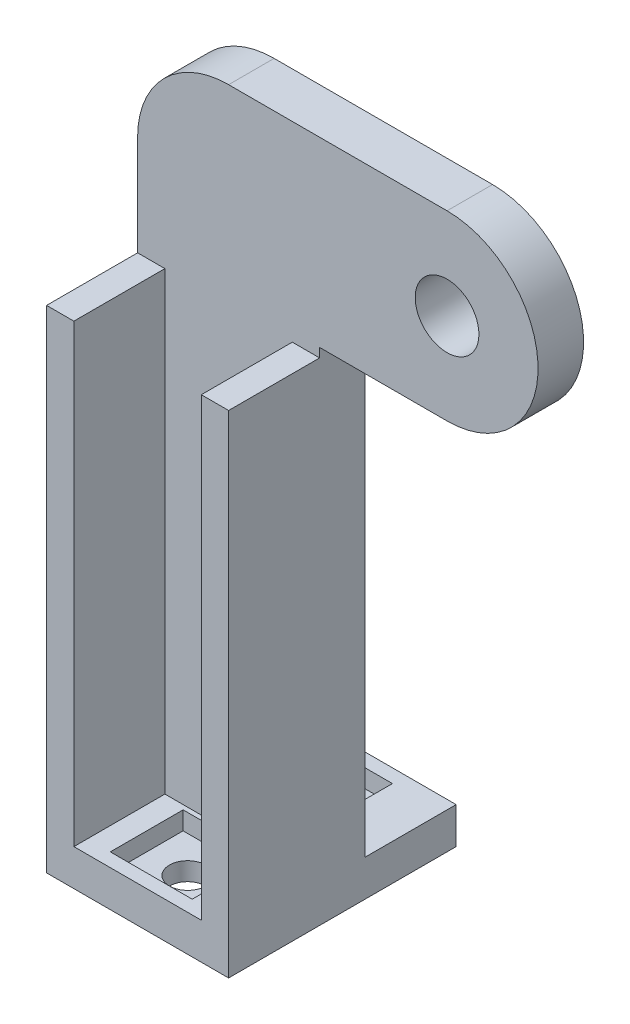
ISO-10303-21;
HEADER;
FILE_DESCRIPTION(('STEP AP214'),'2;1');
FILE_NAME('part.step','',(''),(''),'','','');
FILE_SCHEMA(('AUTOMOTIVE_DESIGN { 1 0 10303 214 1 1 1 1 }'));
ENDSEC;
DATA;
#1=APPLICATION_CONTEXT('core data for automotive mechanical design processes');
#2=APPLICATION_PROTOCOL_DEFINITION('international standard','automotive_design',2000,#1);
#3=PRODUCT_CONTEXT('',#1,'mechanical');
#4=PRODUCT('Part','Part','',(#3));
#5=PRODUCT_RELATED_PRODUCT_CATEGORY('part','',(#4));
#6=PRODUCT_DEFINITION_FORMATION('','',#4);
#7=PRODUCT_DEFINITION_CONTEXT('part definition',#1,'design');
#8=PRODUCT_DEFINITION('design','',#6,#7);
#9=PRODUCT_DEFINITION_SHAPE('','',#8);
#10=(LENGTH_UNIT() NAMED_UNIT(*) SI_UNIT(.MILLI.,.METRE.));
#11=(NAMED_UNIT(*) PLANE_ANGLE_UNIT() SI_UNIT($,.RADIAN.));
#12=(NAMED_UNIT(*) SI_UNIT($,.STERADIAN.) SOLID_ANGLE_UNIT());
#13=UNCERTAINTY_MEASURE_WITH_UNIT(LENGTH_MEASURE(1.E-05),#10,'distance_accuracy_value','');
#14=(GEOMETRIC_REPRESENTATION_CONTEXT(3) GLOBAL_UNCERTAINTY_ASSIGNED_CONTEXT((#13)) GLOBAL_UNIT_ASSIGNED_CONTEXT((#10,
#11,#12)) REPRESENTATION_CONTEXT('',''));
#15=CARTESIAN_POINT('',(0.,0.,0.));
#16=DIRECTION('',(0.,0.,1.));
#17=DIRECTION('',(1.,0.,0.));
#18=AXIS2_PLACEMENT_3D('',#15,#16,#17);
#19=CARTESIAN_POINT('',(0.,0.,2.5));
#20=DIRECTION('',(0.,0.,1.));
#21=DIRECTION('',(1.,0.,0.));
#22=AXIS2_PLACEMENT_3D('',#19,#20,#21);
#23=PLANE('',#22);
#24=DIRECTION('',(0.,-1.,0.));
#25=VECTOR('',#24,1.);
#26=CARTESIAN_POINT('',(3.5,27.,2.5));
#27=LINE('',#26,#25);
#28=CARTESIAN_POINT('',(3.5,27.,2.5));
#29=VERTEX_POINT('',#28);
#30=CARTESIAN_POINT('',(3.5,2.,2.5));
#31=VERTEX_POINT('',#30);
#32=EDGE_CURVE('E58',#29,#31,#27,.T.);
#33=ORIENTED_EDGE('',*,*,#32,.F.);
#34=DIRECTION('',(1.,0.,0.));
#35=VECTOR('',#34,1.);
#36=CARTESIAN_POINT('',(5.,27.,2.5));
#37=LINE('',#36,#35);
#38=CARTESIAN_POINT('',(5.,27.,2.5));
#39=VERTEX_POINT('',#38);
#40=EDGE_CURVE('E211',#29,#39,#37,.T.);
#41=ORIENTED_EDGE('',*,*,#40,.T.);
#42=DIRECTION('',(0.,1.,0.));
#43=VECTOR('',#42,1.);
#44=CARTESIAN_POINT('',(5.,0.,2.5));
#45=LINE('',#44,#43);
#46=CARTESIAN_POINT('',(5.,27.5,2.5));
#47=VERTEX_POINT('',#46);
#48=EDGE_CURVE('E349',#39,#47,#45,.T.);
#49=ORIENTED_EDGE('',*,*,#48,.T.);
#50=DIRECTION('',(1.,0.,0.));
#51=VECTOR('',#50,1.);
#52=CARTESIAN_POINT('',(0.,27.5,2.5));
#53=LINE('',#52,#51);
#54=CARTESIAN_POINT('',(12.,27.5,2.5));
#55=VERTEX_POINT('',#54);
#56=EDGE_CURVE('E351',#47,#55,#53,.T.);
#57=ORIENTED_EDGE('',*,*,#56,.T.);
#58=CARTESIAN_POINT('',(12.,32.5,2.5));
#59=DIRECTION('',(0.,0.,1.));
#60=DIRECTION('',(1.,0.,0.));
#61=AXIS2_PLACEMENT_3D('',#58,#59,#60);
#62=CIRCLE('',#61,4.99999999999999);
#63=CARTESIAN_POINT('',(12.,37.5,2.5));
#64=VERTEX_POINT('',#63);
#65=EDGE_CURVE('E353',#55,#64,#62,.T.);
#66=ORIENTED_EDGE('',*,*,#65,.T.);
#67=DIRECTION('',(1.,0.,0.));
#68=VECTOR('',#67,1.);
#69=CARTESIAN_POINT('',(0.,37.5,2.5));
#70=LINE('',#69,#68);
#71=CARTESIAN_POINT('',(0.,37.5,2.5));
#72=VERTEX_POINT('',#71);
#73=EDGE_CURVE('E340',#72,#64,#70,.T.);
#74=ORIENTED_EDGE('',*,*,#73,.F.);
#75=CARTESIAN_POINT('',(0.,32.5,2.5));
#76=DIRECTION('',(0.,0.,1.));
#77=DIRECTION('',(1.,0.,0.));
#78=AXIS2_PLACEMENT_3D('',#75,#76,#77);
#79=CIRCLE('',#78,5.);
#80=CARTESIAN_POINT('',(-5.,32.5,2.5));
#81=VERTEX_POINT('',#80);
#82=EDGE_CURVE('E343',#72,#81,#79,.T.);
#83=ORIENTED_EDGE('',*,*,#82,.T.);
#84=DIRECTION('',(0.,1.,0.));
#85=VECTOR('',#84,1.);
#86=CARTESIAN_POINT('',(-5.,0.,2.5));
#87=LINE('',#86,#85);
#88=CARTESIAN_POINT('',(-5.,27.,2.5));
#89=VERTEX_POINT('',#88);
#90=EDGE_CURVE('E347',#89,#81,#87,.T.);
#91=ORIENTED_EDGE('',*,*,#90,.F.);
#92=DIRECTION('',(-1.,0.,0.));
#93=VECTOR('',#92,1.);
#94=CARTESIAN_POINT('',(-5.,27.,2.5));
#95=LINE('',#94,#93);
#96=CARTESIAN_POINT('',(-3.5,27.,2.5));
#97=VERTEX_POINT('',#96);
#98=EDGE_CURVE('E233',#97,#89,#95,.T.);
#99=ORIENTED_EDGE('',*,*,#98,.F.);
#100=DIRECTION('',(0.,-1.,0.));
#101=VECTOR('',#100,1.);
#102=CARTESIAN_POINT('',(-3.5,27.,2.5));
#103=LINE('',#102,#101);
#104=CARTESIAN_POINT('',(-3.5,2.,2.5));
#105=VERTEX_POINT('',#104);
#106=EDGE_CURVE('E236',#97,#105,#103,.T.);
#107=ORIENTED_EDGE('',*,*,#106,.T.);
#108=DIRECTION('',(1.,0.,0.));
#109=VECTOR('',#108,1.);
#110=CARTESIAN_POINT('',(0.,2.,2.5));
#111=LINE('',#110,#109);
#112=EDGE_CURVE('E335',#105,#31,#111,.T.);
#113=ORIENTED_EDGE('',*,*,#112,.T.);
#114=EDGE_LOOP('',(#33,#41,#49,#57,#66,#74,#83,#91,#99,#107,#113));
#115=FACE_BOUND('',#114,.T.);
#116=CARTESIAN_POINT('',(12.,32.5,2.5));
#117=DIRECTION('',(0.,0.,1.));
#118=DIRECTION('',(1.,0.,0.));
#119=AXIS2_PLACEMENT_3D('',#116,#117,#118);
#120=CIRCLE('',#119,1.75);
#121=CARTESIAN_POINT('',(13.75,32.5,2.5));
#122=VERTEX_POINT('',#121);
#123=EDGE_CURVE('E355',#122,#122,#120,.T.);
#124=ORIENTED_EDGE('',*,*,#123,.F.);
#125=EDGE_LOOP('',(#124));
#126=FACE_BOUND('',#125,.T.);
#127=ADVANCED_FACE('F41',(#115,#126),#23,.T.);
#128=CARTESIAN_POINT('',(0.,2.,-5.));
#129=DIRECTION('',(0.,-1.,0.));
#130=DIRECTION('',(0.,0.,-1.));
#131=AXIS2_PLACEMENT_3D('',#128,#129,#130);
#132=PLANE('',#131);
#133=DIRECTION('',(-1.,0.,0.));
#134=VECTOR('',#133,1.);
#135=CARTESIAN_POINT('',(-2.25,2.,2.75));
#136=LINE('',#135,#134);
#137=CARTESIAN_POINT('',(2.25,2.,2.75));
#138=VERTEX_POINT('',#137);
#139=CARTESIAN_POINT('',(-2.25,2.,2.75));
#140=VERTEX_POINT('',#139);
#141=EDGE_CURVE('E260',#138,#140,#136,.T.);
#142=ORIENTED_EDGE('',*,*,#141,.F.);
#143=DIRECTION('',(0.,0.,-1.));
#144=VECTOR('',#143,1.);
#145=CARTESIAN_POINT('',(2.25,2.,6.75));
#146=LINE('',#145,#144);
#147=CARTESIAN_POINT('',(2.25,2.,6.75));
#148=VERTEX_POINT('',#147);
#149=EDGE_CURVE('E258',#148,#138,#146,.T.);
#150=ORIENTED_EDGE('',*,*,#149,.F.);
#151=DIRECTION('',(1.,0.,0.));
#152=VECTOR('',#151,1.);
#153=CARTESIAN_POINT('',(-2.25,2.,6.75));
#154=LINE('',#153,#152);
#155=CARTESIAN_POINT('',(-2.25,2.,6.75));
#156=VERTEX_POINT('',#155);
#157=EDGE_CURVE('E248',#156,#148,#154,.T.);
#158=ORIENTED_EDGE('',*,*,#157,.F.);
#159=DIRECTION('',(0.,0.,1.));
#160=VECTOR('',#159,1.);
#161=CARTESIAN_POINT('',(-2.25,2.,6.75));
#162=LINE('',#161,#160);
#163=EDGE_CURVE('E264',#140,#156,#162,.T.);
#164=ORIENTED_EDGE('',*,*,#163,.F.);
#165=EDGE_LOOP('',(#142,#150,#158,#164));
#166=FACE_BOUND('',#165,.T.);
#167=DIRECTION('',(1.,0.,0.));
#168=VECTOR('',#167,1.);
#169=CARTESIAN_POINT('',(0.,2.,7.5));
#170=LINE('',#169,#168);
#171=CARTESIAN_POINT('',(-3.5,2.,7.5));
#172=VERTEX_POINT('',#171);
#173=CARTESIAN_POINT('',(3.5,2.,7.5));
#174=VERTEX_POINT('',#173);
#175=EDGE_CURVE('E311',#172,#174,#170,.T.);
#176=ORIENTED_EDGE('',*,*,#175,.T.);
#177=DIRECTION('',(0.,0.,-1.));
#178=VECTOR('',#177,1.);
#179=CARTESIAN_POINT('',(3.5,2.,2.5));
#180=LINE('',#179,#178);
#181=EDGE_CURVE('E66',#174,#31,#180,.T.);
#182=ORIENTED_EDGE('',*,*,#181,.T.);
#183=ORIENTED_EDGE('',*,*,#112,.F.);
#184=DIRECTION('',(0.,0.,-1.));
#185=VECTOR('',#184,1.);
#186=CARTESIAN_POINT('',(-3.5,2.,2.5));
#187=LINE('',#186,#185);
#188=EDGE_CURVE('E224',#172,#105,#187,.T.);
#189=ORIENTED_EDGE('',*,*,#188,.F.);
#190=EDGE_LOOP('',(#176,#182,#183,#189));
#191=FACE_BOUND('',#190,.T.);
#192=ADVANCED_FACE('F417',(#166,#191),#132,.F.);
#193=CARTESIAN_POINT('',(0.,0.,0.));
#194=DIRECTION('',(0.,0.,1.));
#195=DIRECTION('',(1.,0.,0.));
#196=AXIS2_PLACEMENT_3D('',#193,#194,#195);
#197=PLANE('',#196);
#198=CARTESIAN_POINT('',(12.,32.5,0.));
#199=DIRECTION('',(0.,0.,1.));
#200=DIRECTION('',(1.,0.,0.));
#201=AXIS2_PLACEMENT_3D('',#198,#199,#200);
#202=CIRCLE('',#201,1.75);
#203=CARTESIAN_POINT('',(13.75,32.5,0.));
#204=VERTEX_POINT('',#203);
#205=EDGE_CURVE('E344',#204,#204,#202,.T.);
#206=ORIENTED_EDGE('',*,*,#205,.T.);
#207=EDGE_LOOP('',(#206));
#208=FACE_BOUND('',#207,.T.);
#209=DIRECTION('',(1.,0.,0.));
#210=VECTOR('',#209,1.);
#211=CARTESIAN_POINT('',(0.,2.,0.));
#212=LINE('',#211,#210);
#213=CARTESIAN_POINT('',(-5.,2.,0.));
#214=VERTEX_POINT('',#213);
#215=CARTESIAN_POINT('',(5.,2.,0.));
#216=VERTEX_POINT('',#215);
#217=EDGE_CURVE('E11',#214,#216,#212,.T.);
#218=ORIENTED_EDGE('',*,*,#217,.F.);
#219=DIRECTION('',(0.,1.,0.));
#220=VECTOR('',#219,1.);
#221=CARTESIAN_POINT('',(-5.,0.,0.));
#222=LINE('',#221,#220);
#223=CARTESIAN_POINT('',(-5.,32.5,0.));
#224=VERTEX_POINT('',#223);
#225=EDGE_CURVE('E364',#214,#224,#222,.T.);
#226=ORIENTED_EDGE('',*,*,#225,.T.);
#227=CARTESIAN_POINT('',(0.,32.5,0.));
#228=DIRECTION('',(0.,0.,1.));
#229=DIRECTION('',(1.,0.,0.));
#230=AXIS2_PLACEMENT_3D('',#227,#228,#229);
#231=CIRCLE('',#230,5.);
#232=CARTESIAN_POINT('',(0.,37.5,0.));
#233=VERTEX_POINT('',#232);
#234=EDGE_CURVE('E361',#233,#224,#231,.T.);
#235=ORIENTED_EDGE('',*,*,#234,.F.);
#236=DIRECTION('',(1.,0.,0.));
#237=VECTOR('',#236,1.);
#238=CARTESIAN_POINT('',(0.,37.5,0.));
#239=LINE('',#238,#237);
#240=CARTESIAN_POINT('',(12.,37.5,0.));
#241=VERTEX_POINT('',#240);
#242=EDGE_CURVE('E339',#233,#241,#239,.T.);
#243=ORIENTED_EDGE('',*,*,#242,.T.);
#244=CARTESIAN_POINT('',(12.,32.5,0.));
#245=DIRECTION('',(0.,0.,1.));
#246=DIRECTION('',(1.,0.,0.));
#247=AXIS2_PLACEMENT_3D('',#244,#245,#246);
#248=CIRCLE('',#247,4.99999999999999);
#249=CARTESIAN_POINT('',(12.,27.5,0.));
#250=VERTEX_POINT('',#249);
#251=EDGE_CURVE('E370',#250,#241,#248,.T.);
#252=ORIENTED_EDGE('',*,*,#251,.F.);
#253=DIRECTION('',(1.,0.,0.));
#254=VECTOR('',#253,1.);
#255=CARTESIAN_POINT('',(0.,27.5,0.));
#256=LINE('',#255,#254);
#257=CARTESIAN_POINT('',(5.,27.5,0.));
#258=VERTEX_POINT('',#257);
#259=EDGE_CURVE('E368',#258,#250,#256,.T.);
#260=ORIENTED_EDGE('',*,*,#259,.F.);
#261=DIRECTION('',(0.,1.,0.));
#262=VECTOR('',#261,1.);
#263=CARTESIAN_POINT('',(5.,0.,0.));
#264=LINE('',#263,#262);
#265=EDGE_CURVE('E366',#216,#258,#264,.T.);
#266=ORIENTED_EDGE('',*,*,#265,.F.);
#267=EDGE_LOOP('',(#218,#226,#235,#243,#252,#260,#266));
#268=FACE_BOUND('',#267,.T.);
#269=ADVANCED_FACE('F423',(#208,#268),#197,.F.);
#270=CARTESIAN_POINT('',(0.,37.5,2.5));
#271=DIRECTION('',(0.,1.,0.));
#272=DIRECTION('',(0.,0.,1.));
#273=AXIS2_PLACEMENT_3D('',#270,#271,#272);
#274=PLANE('',#273);
#275=ORIENTED_EDGE('',*,*,#242,.F.);
#276=DIRECTION('',(0.,0.,-1.));
#277=VECTOR('',#276,1.);
#278=CARTESIAN_POINT('',(0.,37.5,2.5));
#279=LINE('',#278,#277);
#280=EDGE_CURVE('E50',#72,#233,#279,.T.);
#281=ORIENTED_EDGE('',*,*,#280,.F.);
#282=ORIENTED_EDGE('',*,*,#73,.T.);
#283=DIRECTION('',(0.,0.,-1.));
#284=VECTOR('',#283,1.);
#285=CARTESIAN_POINT('',(12.,37.5,2.5));
#286=LINE('',#285,#284);
#287=EDGE_CURVE('E358',#64,#241,#286,.T.);
#288=ORIENTED_EDGE('',*,*,#287,.T.);
#289=EDGE_LOOP('',(#275,#281,#282,#288));
#290=FACE_BOUND('',#289,.T.);
#291=ADVANCED_FACE('F43',(#290),#274,.T.);
#292=CARTESIAN_POINT('',(0.,32.5,2.5));
#293=DIRECTION('',(0.,0.,-1.));
#294=DIRECTION('',(-1.,0.,0.));
#295=AXIS2_PLACEMENT_3D('',#292,#293,#294);
#296=CYLINDRICAL_SURFACE('',#295,5.);
#297=ORIENTED_EDGE('',*,*,#234,.T.);
#298=DIRECTION('',(0.,0.,-1.));
#299=VECTOR('',#298,1.);
#300=CARTESIAN_POINT('',(-5.,32.5,2.5));
#301=LINE('',#300,#299);
#302=EDGE_CURVE('E386',#81,#224,#301,.T.);
#303=ORIENTED_EDGE('',*,*,#302,.F.);
#304=ORIENTED_EDGE('',*,*,#82,.F.);
#305=ORIENTED_EDGE('',*,*,#280,.T.);
#306=EDGE_LOOP('',(#297,#303,#304,#305));
#307=FACE_BOUND('',#306,.T.);
#308=ADVANCED_FACE('F456',(#307),#296,.T.);
#309=CARTESIAN_POINT('',(-5.,0.,2.5));
#310=DIRECTION('',(-1.,0.,0.));
#311=DIRECTION('',(0.,0.,1.));
#312=AXIS2_PLACEMENT_3D('',#309,#310,#311);
#313=PLANE('',#312);
#314=DIRECTION('',(0.,0.,1.));
#315=VECTOR('',#314,1.);
#316=CARTESIAN_POINT('',(-5.,27.,2.5));
#317=LINE('',#316,#315);
#318=CARTESIAN_POINT('',(-5.,27.,7.5));
#319=VERTEX_POINT('',#318);
#320=EDGE_CURVE('E225',#89,#319,#317,.T.);
#321=ORIENTED_EDGE('',*,*,#320,.F.);
#322=ORIENTED_EDGE('',*,*,#90,.T.);
#323=ORIENTED_EDGE('',*,*,#302,.T.);
#324=ORIENTED_EDGE('',*,*,#225,.F.);
#325=DIRECTION('',(0.,0.,1.));
#326=VECTOR('',#325,1.);
#327=CARTESIAN_POINT('',(-5.,2.,-5.));
#328=LINE('',#327,#326);
#329=CARTESIAN_POINT('',(-5.,2.,-5.));
#330=VERTEX_POINT('',#329);
#331=EDGE_CURVE('E331',#330,#214,#328,.T.);
#332=ORIENTED_EDGE('',*,*,#331,.F.);
#333=DIRECTION('',(0.,1.,0.));
#334=VECTOR('',#333,1.);
#335=CARTESIAN_POINT('',(-5.,0.,-5.));
#336=LINE('',#335,#334);
#337=CARTESIAN_POINT('',(-5.,0.,-5.));
#338=VERTEX_POINT('',#337);
#339=EDGE_CURVE('E323',#338,#330,#336,.T.);
#340=ORIENTED_EDGE('',*,*,#339,.F.);
#341=DIRECTION('',(0.,0.,-1.));
#342=VECTOR('',#341,1.);
#343=CARTESIAN_POINT('',(-5.,0.,2.5));
#344=LINE('',#343,#342);
#345=CARTESIAN_POINT('',(-5.,0.,7.5));
#346=VERTEX_POINT('',#345);
#347=EDGE_CURVE('E384',#346,#338,#344,.T.);
#348=ORIENTED_EDGE('',*,*,#347,.F.);
#349=DIRECTION('',(0.,1.,0.));
#350=VECTOR('',#349,1.);
#351=CARTESIAN_POINT('',(-5.,0.,7.5));
#352=LINE('',#351,#350);
#353=EDGE_CURVE('E316',#346,#319,#352,.T.);
#354=ORIENTED_EDGE('',*,*,#353,.T.);
#355=EDGE_LOOP('',(#321,#322,#323,#324,#332,#340,#348,#354));
#356=FACE_BOUND('',#355,.T.);
#357=ADVANCED_FACE('F453',(#356),#313,.T.);
#358=CARTESIAN_POINT('',(0.,0.,2.5));
#359=DIRECTION('',(0.,1.,0.));
#360=DIRECTION('',(0.,0.,1.));
#361=AXIS2_PLACEMENT_3D('',#358,#359,#360);
#362=PLANE('',#361);
#363=CARTESIAN_POINT('',(0.,0.,-2.25));
#364=DIRECTION('',(0.,1.,0.));
#365=DIRECTION('',(0.,0.,1.));
#366=AXIS2_PLACEMENT_3D('',#363,#364,#365);
#367=CIRCLE('',#366,1.);
#368=CARTESIAN_POINT('',(0.,0.,-1.25));
#369=VERTEX_POINT('',#368);
#370=EDGE_CURVE('E308',#369,#369,#367,.T.);
#371=ORIENTED_EDGE('',*,*,#370,.T.);
#372=EDGE_LOOP('',(#371));
#373=FACE_BOUND('',#372,.T.);
#374=CARTESIAN_POINT('',(0.,0.,4.75));
#375=DIRECTION('',(0.,1.,0.));
#376=DIRECTION('',(0.,0.,1.));
#377=AXIS2_PLACEMENT_3D('',#374,#375,#376);
#378=CIRCLE('',#377,1.);
#379=CARTESIAN_POINT('',(0.,0.,5.75));
#380=VERTEX_POINT('',#379);
#381=EDGE_CURVE('E312',#380,#380,#378,.T.);
#382=ORIENTED_EDGE('',*,*,#381,.T.);
#383=EDGE_LOOP('',(#382));
#384=FACE_BOUND('',#383,.T.);
#385=ORIENTED_EDGE('',*,*,#347,.T.);
#386=DIRECTION('',(1.,0.,0.));
#387=VECTOR('',#386,1.);
#388=CARTESIAN_POINT('',(0.,0.,-5.));
#389=LINE('',#388,#387);
#390=CARTESIAN_POINT('',(5.,0.,-5.));
#391=VERTEX_POINT('',#390);
#392=EDGE_CURVE('E325',#338,#391,#389,.T.);
#393=ORIENTED_EDGE('',*,*,#392,.T.);
#394=DIRECTION('',(0.,0.,-1.));
#395=VECTOR('',#394,1.);
#396=CARTESIAN_POINT('',(5.,0.,2.5));
#397=LINE('',#396,#395);
#398=CARTESIAN_POINT('',(5.,0.,7.5));
#399=VERTEX_POINT('',#398);
#400=EDGE_CURVE('E382',#399,#391,#397,.T.);
#401=ORIENTED_EDGE('',*,*,#400,.F.);
#402=DIRECTION('',(1.,0.,0.));
#403=VECTOR('',#402,1.);
#404=CARTESIAN_POINT('',(0.,0.,7.5));
#405=LINE('',#404,#403);
#406=EDGE_CURVE('E318',#346,#399,#405,.T.);
#407=ORIENTED_EDGE('',*,*,#406,.F.);
#408=EDGE_LOOP('',(#385,#393,#401,#407));
#409=FACE_BOUND('',#408,.T.);
#410=ADVANCED_FACE('F449',(#373,#384,#409),#362,.F.);
#411=CARTESIAN_POINT('',(5.,0.,2.5));
#412=DIRECTION('',(-1.,0.,0.));
#413=DIRECTION('',(0.,0.,1.));
#414=AXIS2_PLACEMENT_3D('',#411,#412,#413);
#415=PLANE('',#414);
#416=ORIENTED_EDGE('',*,*,#48,.F.);
#417=DIRECTION('',(0.,0.,1.));
#418=VECTOR('',#417,1.);
#419=CARTESIAN_POINT('',(5.,27.,2.5));
#420=LINE('',#419,#418);
#421=CARTESIAN_POINT('',(5.,27.,7.5));
#422=VERTEX_POINT('',#421);
#423=EDGE_CURVE('E221',#39,#422,#420,.T.);
#424=ORIENTED_EDGE('',*,*,#423,.T.);
#425=DIRECTION('',(0.,1.,0.));
#426=VECTOR('',#425,1.);
#427=CARTESIAN_POINT('',(5.,0.,7.5));
#428=LINE('',#427,#426);
#429=EDGE_CURVE('E216',#399,#422,#428,.T.);
#430=ORIENTED_EDGE('',*,*,#429,.F.);
#431=ORIENTED_EDGE('',*,*,#400,.T.);
#432=DIRECTION('',(0.,1.,0.));
#433=VECTOR('',#432,1.);
#434=CARTESIAN_POINT('',(5.,0.,-5.));
#435=LINE('',#434,#433);
#436=CARTESIAN_POINT('',(5.,2.,-5.));
#437=VERTEX_POINT('',#436);
#438=EDGE_CURVE('E328',#391,#437,#435,.T.);
#439=ORIENTED_EDGE('',*,*,#438,.T.);
#440=DIRECTION('',(0.,0.,1.));
#441=VECTOR('',#440,1.);
#442=CARTESIAN_POINT('',(5.,2.,-5.));
#443=LINE('',#442,#441);
#444=EDGE_CURVE('E332',#437,#216,#443,.T.);
#445=ORIENTED_EDGE('',*,*,#444,.T.);
#446=ORIENTED_EDGE('',*,*,#265,.T.);
#447=DIRECTION('',(0.,0.,-1.));
#448=VECTOR('',#447,1.);
#449=CARTESIAN_POINT('',(5.,27.5,2.5));
#450=LINE('',#449,#448);
#451=EDGE_CURVE('E379',#47,#258,#450,.T.);
#452=ORIENTED_EDGE('',*,*,#451,.F.);
#453=EDGE_LOOP('',(#416,#424,#430,#431,#439,#445,#446,#452));
#454=FACE_BOUND('',#453,.T.);
#455=ADVANCED_FACE('F445',(#454),#415,.F.);
#456=CARTESIAN_POINT('',(0.,27.5,2.5));
#457=DIRECTION('',(0.,1.,0.));
#458=DIRECTION('',(0.,0.,1.));
#459=AXIS2_PLACEMENT_3D('',#456,#457,#458);
#460=PLANE('',#459);
#461=ORIENTED_EDGE('',*,*,#259,.T.);
#462=DIRECTION('',(0.,0.,-1.));
#463=VECTOR('',#462,1.);
#464=CARTESIAN_POINT('',(12.,27.5,2.5));
#465=LINE('',#464,#463);
#466=EDGE_CURVE('E376',#55,#250,#465,.T.);
#467=ORIENTED_EDGE('',*,*,#466,.F.);
#468=ORIENTED_EDGE('',*,*,#56,.F.);
#469=ORIENTED_EDGE('',*,*,#451,.T.);
#470=EDGE_LOOP('',(#461,#467,#468,#469));
#471=FACE_BOUND('',#470,.T.);
#472=ADVANCED_FACE('F441',(#471),#460,.F.);
#473=CARTESIAN_POINT('',(12.,32.5,2.5));
#474=DIRECTION('',(0.,0.,-1.));
#475=DIRECTION('',(-1.,0.,0.));
#476=AXIS2_PLACEMENT_3D('',#473,#474,#475);
#477=CYLINDRICAL_SURFACE('',#476,4.99999999999999);
#478=ORIENTED_EDGE('',*,*,#251,.T.);
#479=ORIENTED_EDGE('',*,*,#287,.F.);
#480=ORIENTED_EDGE('',*,*,#65,.F.);
#481=ORIENTED_EDGE('',*,*,#466,.T.);
#482=EDGE_LOOP('',(#478,#479,#480,#481));
#483=FACE_BOUND('',#482,.T.);
#484=ADVANCED_FACE('F437',(#483),#477,.T.);
#485=CARTESIAN_POINT('',(12.,32.5,2.5));
#486=DIRECTION('',(0.,0.,-1.));
#487=DIRECTION('',(-1.,0.,0.));
#488=AXIS2_PLACEMENT_3D('',#485,#486,#487);
#489=CYLINDRICAL_SURFACE('',#488,1.75);
#490=ORIENTED_EDGE('',*,*,#123,.T.);
#491=EDGE_LOOP('',(#490));
#492=FACE_BOUND('',#491,.T.);
#493=ORIENTED_EDGE('',*,*,#205,.F.);
#494=EDGE_LOOP('',(#493));
#495=FACE_BOUND('',#494,.T.);
#496=ADVANCED_FACE('F433',(#492,#495),#489,.F.);
#497=CARTESIAN_POINT('',(0.,0.,-5.));
#498=DIRECTION('',(0.,0.,1.));
#499=DIRECTION('',(1.,0.,0.));
#500=AXIS2_PLACEMENT_3D('',#497,#498,#499);
#501=PLANE('',#500);
#502=DIRECTION('',(1.,0.,0.));
#503=VECTOR('',#502,1.);
#504=CARTESIAN_POINT('',(0.,2.,-5.));
#505=LINE('',#504,#503);
#506=EDGE_CURVE('E321',#330,#437,#505,.T.);
#507=ORIENTED_EDGE('',*,*,#506,.T.);
#508=ORIENTED_EDGE('',*,*,#438,.F.);
#509=ORIENTED_EDGE('',*,*,#392,.F.);
#510=ORIENTED_EDGE('',*,*,#339,.T.);
#511=EDGE_LOOP('',(#507,#508,#509,#510));
#512=FACE_BOUND('',#511,.T.);
#513=ADVANCED_FACE('F436',(#512),#501,.F.);
#514=DIRECTION('',(-1.,0.,0.));
#515=VECTOR('',#514,1.);
#516=CARTESIAN_POINT('',(-2.25,2.,-4.25));
#517=LINE('',#516,#515);
#518=CARTESIAN_POINT('',(2.25,2.,-4.25));
#519=VERTEX_POINT('',#518);
#520=CARTESIAN_POINT('',(-2.25,2.,-4.25));
#521=VERTEX_POINT('',#520);
#522=EDGE_CURVE('E294',#519,#521,#517,.T.);
#523=ORIENTED_EDGE('',*,*,#522,.F.);
#524=DIRECTION('',(0.,0.,-1.));
#525=VECTOR('',#524,1.);
#526=CARTESIAN_POINT('',(2.25,2.,-0.25));
#527=LINE('',#526,#525);
#528=CARTESIAN_POINT('',(2.25,2.,-0.25));
#529=VERTEX_POINT('',#528);
#530=EDGE_CURVE('E261',#529,#519,#527,.T.);
#531=ORIENTED_EDGE('',*,*,#530,.F.);
#532=DIRECTION('',(1.,0.,0.));
#533=VECTOR('',#532,1.);
#534=CARTESIAN_POINT('',(-2.25,2.,-0.25));
#535=LINE('',#534,#533);
#536=CARTESIAN_POINT('',(-2.25,2.,-0.25));
#537=VERTEX_POINT('',#536);
#538=EDGE_CURVE('E287',#537,#529,#535,.T.);
#539=ORIENTED_EDGE('',*,*,#538,.F.);
#540=DIRECTION('',(0.,0.,1.));
#541=VECTOR('',#540,1.);
#542=CARTESIAN_POINT('',(-2.25,2.,-0.25));
#543=LINE('',#542,#541);
#544=EDGE_CURVE('E290',#521,#537,#543,.T.);
#545=ORIENTED_EDGE('',*,*,#544,.F.);
#546=EDGE_LOOP('',(#523,#531,#539,#545));
#547=FACE_BOUND('',#546,.T.);
#548=ORIENTED_EDGE('',*,*,#331,.T.);
#549=ORIENTED_EDGE('',*,*,#217,.T.);
#550=ORIENTED_EDGE('',*,*,#444,.F.);
#551=ORIENTED_EDGE('',*,*,#506,.F.);
#552=EDGE_LOOP('',(#548,#549,#550,#551));
#553=FACE_BOUND('',#552,.T.);
#554=ADVANCED_FACE('F426',(#547,#553),#132,.F.);
#555=CARTESIAN_POINT('',(0.,0.,7.5));
#556=DIRECTION('',(0.,0.,1.));
#557=DIRECTION('',(1.,0.,0.));
#558=AXIS2_PLACEMENT_3D('',#555,#556,#557);
#559=PLANE('',#558);
#560=ORIENTED_EDGE('',*,*,#175,.F.);
#561=DIRECTION('',(0.,-1.,0.));
#562=VECTOR('',#561,1.);
#563=CARTESIAN_POINT('',(-3.5,27.,7.5));
#564=LINE('',#563,#562);
#565=CARTESIAN_POINT('',(-3.5,27.,7.5));
#566=VERTEX_POINT('',#565);
#567=EDGE_CURVE('E240',#566,#172,#564,.T.);
#568=ORIENTED_EDGE('',*,*,#567,.F.);
#569=DIRECTION('',(1.,0.,0.));
#570=VECTOR('',#569,1.);
#571=CARTESIAN_POINT('',(-5.,27.,7.5));
#572=LINE('',#571,#570);
#573=EDGE_CURVE('E228',#319,#566,#572,.T.);
#574=ORIENTED_EDGE('',*,*,#573,.F.);
#575=ORIENTED_EDGE('',*,*,#353,.F.);
#576=ORIENTED_EDGE('',*,*,#406,.T.);
#577=ORIENTED_EDGE('',*,*,#429,.T.);
#578=DIRECTION('',(-1.,0.,0.));
#579=VECTOR('',#578,1.);
#580=CARTESIAN_POINT('',(5.,27.,7.5));
#581=LINE('',#580,#579);
#582=CARTESIAN_POINT('',(3.5,27.,7.5));
#583=VERTEX_POINT('',#582);
#584=EDGE_CURVE('E205',#422,#583,#581,.T.);
#585=ORIENTED_EDGE('',*,*,#584,.T.);
#586=DIRECTION('',(0.,-1.,0.));
#587=VECTOR('',#586,1.);
#588=CARTESIAN_POINT('',(3.5,27.,7.5));
#589=LINE('',#588,#587);
#590=EDGE_CURVE('E199',#583,#174,#589,.T.);
#591=ORIENTED_EDGE('',*,*,#590,.T.);
#592=EDGE_LOOP('',(#560,#568,#574,#575,#576,#577,#585,#591));
#593=FACE_BOUND('',#592,.T.);
#594=ADVANCED_FACE('F213',(#593),#559,.T.);
#595=CARTESIAN_POINT('',(0.,0.,4.75));
#596=DIRECTION('',(0.,1.,0.));
#597=DIRECTION('',(0.,0.,1.));
#598=AXIS2_PLACEMENT_3D('',#595,#596,#597);
#599=CYLINDRICAL_SURFACE('',#598,1.);
#600=CARTESIAN_POINT('',(0.,1.,4.75));
#601=DIRECTION('',(0.,-1.,0.));
#602=DIRECTION('',(0.,0.,-1.));
#603=AXIS2_PLACEMENT_3D('',#600,#601,#602);
#604=CIRCLE('',#603,1.);
#605=CARTESIAN_POINT('',(0.,1.,3.75));
#606=VERTEX_POINT('',#605);
#607=EDGE_CURVE('E45',#606,#606,#604,.F.);
#608=ORIENTED_EDGE('',*,*,#607,.T.);
#609=EDGE_LOOP('',(#608));
#610=FACE_BOUND('',#609,.T.);
#611=ORIENTED_EDGE('',*,*,#381,.F.);
#612=EDGE_LOOP('',(#611));
#613=FACE_BOUND('',#612,.T.);
#614=ADVANCED_FACE('F395',(#610,#613),#599,.F.);
#615=CARTESIAN_POINT('',(0.,0.,-2.25));
#616=DIRECTION('',(0.,1.,0.));
#617=DIRECTION('',(0.,0.,1.));
#618=AXIS2_PLACEMENT_3D('',#615,#616,#617);
#619=CYLINDRICAL_SURFACE('',#618,1.);
#620=CARTESIAN_POINT('',(0.,1.,-2.25));
#621=DIRECTION('',(0.,-1.,0.));
#622=DIRECTION('',(0.,0.,-1.));
#623=AXIS2_PLACEMENT_3D('',#620,#621,#622);
#624=CIRCLE('',#623,1.);
#625=CARTESIAN_POINT('',(0.,1.,-3.25));
#626=VERTEX_POINT('',#625);
#627=EDGE_CURVE('E271',#626,#626,#624,.F.);
#628=ORIENTED_EDGE('',*,*,#627,.T.);
#629=EDGE_LOOP('',(#628));
#630=FACE_BOUND('',#629,.T.);
#631=ORIENTED_EDGE('',*,*,#370,.F.);
#632=EDGE_LOOP('',(#631));
#633=FACE_BOUND('',#632,.T.);
#634=ADVANCED_FACE('F501',(#630,#633),#619,.F.);
#635=CARTESIAN_POINT('',(0.,1.,0.));
#636=DIRECTION('',(0.,-1.,0.));
#637=DIRECTION('',(0.,0.,-1.));
#638=AXIS2_PLACEMENT_3D('',#635,#636,#637);
#639=PLANE('',#638);
#640=DIRECTION('',(0.,0.,-1.));
#641=VECTOR('',#640,1.);
#642=CARTESIAN_POINT('',(2.25,1.,-0.25));
#643=LINE('',#642,#641);
#644=CARTESIAN_POINT('',(2.25,1.,-0.25));
#645=VERTEX_POINT('',#644);
#646=CARTESIAN_POINT('',(2.25,1.,-4.25));
#647=VERTEX_POINT('',#646);
#648=EDGE_CURVE('E291',#645,#647,#643,.T.);
#649=ORIENTED_EDGE('',*,*,#648,.T.);
#650=DIRECTION('',(-1.,0.,0.));
#651=VECTOR('',#650,1.);
#652=CARTESIAN_POINT('',(-2.25,1.,-4.25));
#653=LINE('',#652,#651);
#654=CARTESIAN_POINT('',(-2.25,1.,-4.25));
#655=VERTEX_POINT('',#654);
#656=EDGE_CURVE('E303',#647,#655,#653,.T.);
#657=ORIENTED_EDGE('',*,*,#656,.T.);
#658=DIRECTION('',(0.,0.,1.));
#659=VECTOR('',#658,1.);
#660=CARTESIAN_POINT('',(-2.25,1.,-0.25));
#661=LINE('',#660,#659);
#662=CARTESIAN_POINT('',(-2.25,1.,-0.25));
#663=VERTEX_POINT('',#662);
#664=EDGE_CURVE('E300',#655,#663,#661,.T.);
#665=ORIENTED_EDGE('',*,*,#664,.T.);
#666=DIRECTION('',(1.,0.,0.));
#667=VECTOR('',#666,1.);
#668=CARTESIAN_POINT('',(-2.25,1.,-0.25));
#669=LINE('',#668,#667);
#670=EDGE_CURVE('E281',#663,#645,#669,.T.);
#671=ORIENTED_EDGE('',*,*,#670,.T.);
#672=EDGE_LOOP('',(#649,#657,#665,#671));
#673=FACE_BOUND('',#672,.T.);
#674=ORIENTED_EDGE('',*,*,#627,.F.);
#675=EDGE_LOOP('',(#674));
#676=FACE_BOUND('',#675,.T.);
#677=ADVANCED_FACE('F504',(#673,#676),#639,.F.);
#678=CARTESIAN_POINT('',(2.25,1.,-0.25));
#679=DIRECTION('',(1.,0.,0.));
#680=DIRECTION('',(0.,0.,-1.));
#681=AXIS2_PLACEMENT_3D('',#678,#679,#680);
#682=PLANE('',#681);
#683=ORIENTED_EDGE('',*,*,#530,.T.);
#684=DIRECTION('',(0.,1.,0.));
#685=VECTOR('',#684,1.);
#686=CARTESIAN_POINT('',(2.25,1.,-4.25));
#687=LINE('',#686,#685);
#688=EDGE_CURVE('E278',#647,#519,#687,.T.);
#689=ORIENTED_EDGE('',*,*,#688,.F.);
#690=ORIENTED_EDGE('',*,*,#648,.F.);
#691=DIRECTION('',(0.,1.,0.));
#692=VECTOR('',#691,1.);
#693=CARTESIAN_POINT('',(2.25,1.,-0.25));
#694=LINE('',#693,#692);
#695=EDGE_CURVE('E243',#645,#529,#694,.T.);
#696=ORIENTED_EDGE('',*,*,#695,.T.);
#697=EDGE_LOOP('',(#683,#689,#690,#696));
#698=FACE_BOUND('',#697,.T.);
#699=ADVANCED_FACE('F507',(#698),#682,.F.);
#700=CARTESIAN_POINT('',(-2.25,1.,-0.25));
#701=DIRECTION('',(0.,0.,1.));
#702=DIRECTION('',(1.,0.,0.));
#703=AXIS2_PLACEMENT_3D('',#700,#701,#702);
#704=PLANE('',#703);
#705=ORIENTED_EDGE('',*,*,#538,.T.);
#706=ORIENTED_EDGE('',*,*,#695,.F.);
#707=ORIENTED_EDGE('',*,*,#670,.F.);
#708=DIRECTION('',(0.,1.,0.));
#709=VECTOR('',#708,1.);
#710=CARTESIAN_POINT('',(-2.25,1.,-0.25));
#711=LINE('',#710,#709);
#712=EDGE_CURVE('E284',#663,#537,#711,.T.);
#713=ORIENTED_EDGE('',*,*,#712,.T.);
#714=EDGE_LOOP('',(#705,#706,#707,#713));
#715=FACE_BOUND('',#714,.T.);
#716=ADVANCED_FACE('F509',(#715),#704,.F.);
#717=CARTESIAN_POINT('',(-2.25,1.,-0.25));
#718=DIRECTION('',(-1.,0.,0.));
#719=DIRECTION('',(0.,0.,1.));
#720=AXIS2_PLACEMENT_3D('',#717,#718,#719);
#721=PLANE('',#720);
#722=ORIENTED_EDGE('',*,*,#544,.T.);
#723=ORIENTED_EDGE('',*,*,#712,.F.);
#724=ORIENTED_EDGE('',*,*,#664,.F.);
#725=DIRECTION('',(0.,1.,0.));
#726=VECTOR('',#725,1.);
#727=CARTESIAN_POINT('',(-2.25,1.,-4.25));
#728=LINE('',#727,#726);
#729=EDGE_CURVE('E282',#655,#521,#728,.T.);
#730=ORIENTED_EDGE('',*,*,#729,.T.);
#731=EDGE_LOOP('',(#722,#723,#724,#730));
#732=FACE_BOUND('',#731,.T.);
#733=ADVANCED_FACE('F411',(#732),#721,.F.);
#734=CARTESIAN_POINT('',(-2.25,1.,-4.25));
#735=DIRECTION('',(0.,0.,-1.));
#736=DIRECTION('',(-1.,0.,0.));
#737=AXIS2_PLACEMENT_3D('',#734,#735,#736);
#738=PLANE('',#737);
#739=ORIENTED_EDGE('',*,*,#522,.T.);
#740=ORIENTED_EDGE('',*,*,#729,.F.);
#741=ORIENTED_EDGE('',*,*,#656,.F.);
#742=ORIENTED_EDGE('',*,*,#688,.T.);
#743=EDGE_LOOP('',(#739,#740,#741,#742));
#744=FACE_BOUND('',#743,.T.);
#745=ADVANCED_FACE('F401',(#744),#738,.F.);
#746=CARTESIAN_POINT('',(0.,1.,0.));
#747=DIRECTION('',(0.,-1.,0.));
#748=DIRECTION('',(0.,0.,-1.));
#749=AXIS2_PLACEMENT_3D('',#746,#747,#748);
#750=PLANE('',#749);
#751=DIRECTION('',(0.,0.,-1.));
#752=VECTOR('',#751,1.);
#753=CARTESIAN_POINT('',(2.25,1.,6.75));
#754=LINE('',#753,#752);
#755=CARTESIAN_POINT('',(2.25,1.,6.75));
#756=VERTEX_POINT('',#755);
#757=CARTESIAN_POINT('',(2.25,1.,2.75));
#758=VERTEX_POINT('',#757);
#759=EDGE_CURVE('E244',#756,#758,#754,.T.);
#760=ORIENTED_EDGE('',*,*,#759,.T.);
#761=DIRECTION('',(-1.,0.,0.));
#762=VECTOR('',#761,1.);
#763=CARTESIAN_POINT('',(-2.25,1.,2.75));
#764=LINE('',#763,#762);
#765=CARTESIAN_POINT('',(-2.25,1.,2.75));
#766=VERTEX_POINT('',#765);
#767=EDGE_CURVE('E247',#758,#766,#764,.T.);
#768=ORIENTED_EDGE('',*,*,#767,.T.);
#769=DIRECTION('',(0.,0.,1.));
#770=VECTOR('',#769,1.);
#771=CARTESIAN_POINT('',(-2.25,1.,6.75));
#772=LINE('',#771,#770);
#773=CARTESIAN_POINT('',(-2.25,1.,6.75));
#774=VERTEX_POINT('',#773);
#775=EDGE_CURVE('E251',#766,#774,#772,.T.);
#776=ORIENTED_EDGE('',*,*,#775,.T.);
#777=DIRECTION('',(1.,0.,0.));
#778=VECTOR('',#777,1.);
#779=CARTESIAN_POINT('',(-2.25,1.,6.75));
#780=LINE('',#779,#778);
#781=EDGE_CURVE('E254',#774,#756,#780,.T.);
#782=ORIENTED_EDGE('',*,*,#781,.T.);
#783=EDGE_LOOP('',(#760,#768,#776,#782));
#784=FACE_BOUND('',#783,.T.);
#785=ORIENTED_EDGE('',*,*,#607,.F.);
#786=EDGE_LOOP('',(#785));
#787=FACE_BOUND('',#786,.T.);
#788=ADVANCED_FACE('F398',(#784,#787),#750,.F.);
#789=CARTESIAN_POINT('',(2.25,1.,6.75));
#790=DIRECTION('',(1.,0.,0.));
#791=DIRECTION('',(0.,0.,-1.));
#792=AXIS2_PLACEMENT_3D('',#789,#790,#791);
#793=PLANE('',#792);
#794=ORIENTED_EDGE('',*,*,#149,.T.);
#795=DIRECTION('',(0.,1.,0.));
#796=VECTOR('',#795,1.);
#797=CARTESIAN_POINT('',(2.25,1.,2.75));
#798=LINE('',#797,#796);
#799=EDGE_CURVE('E257',#758,#138,#798,.T.);
#800=ORIENTED_EDGE('',*,*,#799,.F.);
#801=ORIENTED_EDGE('',*,*,#759,.F.);
#802=DIRECTION('',(0.,1.,0.));
#803=VECTOR('',#802,1.);
#804=CARTESIAN_POINT('',(2.25,1.,6.75));
#805=LINE('',#804,#803);
#806=EDGE_CURVE('E269',#756,#148,#805,.T.);
#807=ORIENTED_EDGE('',*,*,#806,.T.);
#808=EDGE_LOOP('',(#794,#800,#801,#807));
#809=FACE_BOUND('',#808,.T.);
#810=ADVANCED_FACE('F400',(#809),#793,.F.);
#811=CARTESIAN_POINT('',(-2.25,1.,6.75));
#812=DIRECTION('',(0.,0.,1.));
#813=DIRECTION('',(1.,0.,0.));
#814=AXIS2_PLACEMENT_3D('',#811,#812,#813);
#815=PLANE('',#814);
#816=ORIENTED_EDGE('',*,*,#157,.T.);
#817=ORIENTED_EDGE('',*,*,#806,.F.);
#818=ORIENTED_EDGE('',*,*,#781,.F.);
#819=DIRECTION('',(0.,1.,0.));
#820=VECTOR('',#819,1.);
#821=CARTESIAN_POINT('',(-2.25,1.,6.75));
#822=LINE('',#821,#820);
#823=EDGE_CURVE('E272',#774,#156,#822,.T.);
#824=ORIENTED_EDGE('',*,*,#823,.T.);
#825=EDGE_LOOP('',(#816,#817,#818,#824));
#826=FACE_BOUND('',#825,.T.);
#827=ADVANCED_FACE('F408',(#826),#815,.F.);
#828=CARTESIAN_POINT('',(-2.25,1.,6.75));
#829=DIRECTION('',(-1.,0.,0.));
#830=DIRECTION('',(0.,0.,1.));
#831=AXIS2_PLACEMENT_3D('',#828,#829,#830);
#832=PLANE('',#831);
#833=ORIENTED_EDGE('',*,*,#163,.T.);
#834=ORIENTED_EDGE('',*,*,#823,.F.);
#835=ORIENTED_EDGE('',*,*,#775,.F.);
#836=DIRECTION('',(0.,1.,0.));
#837=VECTOR('',#836,1.);
#838=CARTESIAN_POINT('',(-2.25,1.,2.75));
#839=LINE('',#838,#837);
#840=EDGE_CURVE('E274',#766,#140,#839,.T.);
#841=ORIENTED_EDGE('',*,*,#840,.T.);
#842=EDGE_LOOP('',(#833,#834,#835,#841));
#843=FACE_BOUND('',#842,.T.);
#844=ADVANCED_FACE('F523',(#843),#832,.F.);
#845=CARTESIAN_POINT('',(-2.25,1.,2.75));
#846=DIRECTION('',(0.,0.,-1.));
#847=DIRECTION('',(-1.,0.,0.));
#848=AXIS2_PLACEMENT_3D('',#845,#846,#847);
#849=PLANE('',#848);
#850=ORIENTED_EDGE('',*,*,#141,.T.);
#851=ORIENTED_EDGE('',*,*,#840,.F.);
#852=ORIENTED_EDGE('',*,*,#767,.F.);
#853=ORIENTED_EDGE('',*,*,#799,.T.);
#854=EDGE_LOOP('',(#850,#851,#852,#853));
#855=FACE_BOUND('',#854,.T.);
#856=ADVANCED_FACE('F519',(#855),#849,.F.);
#857=CARTESIAN_POINT('',(-3.5,27.,2.5));
#858=DIRECTION('',(-1.,0.,0.));
#859=DIRECTION('',(0.,0.,1.));
#860=AXIS2_PLACEMENT_3D('',#857,#858,#859);
#861=PLANE('',#860);
#862=ORIENTED_EDGE('',*,*,#188,.T.);
#863=ORIENTED_EDGE('',*,*,#106,.F.);
#864=DIRECTION('',(0.,0.,-1.));
#865=VECTOR('',#864,1.);
#866=CARTESIAN_POINT('',(-3.5,27.,2.5));
#867=LINE('',#866,#865);
#868=EDGE_CURVE('E230',#566,#97,#867,.T.);
#869=ORIENTED_EDGE('',*,*,#868,.F.);
#870=ORIENTED_EDGE('',*,*,#567,.T.);
#871=EDGE_LOOP('',(#862,#863,#869,#870));
#872=FACE_BOUND('',#871,.T.);
#873=ADVANCED_FACE('F522',(#872),#861,.F.);
#874=CARTESIAN_POINT('',(0.,27.,0.));
#875=DIRECTION('',(0.,1.,0.));
#876=DIRECTION('',(0.,0.,1.));
#877=AXIS2_PLACEMENT_3D('',#874,#875,#876);
#878=PLANE('',#877);
#879=ORIENTED_EDGE('',*,*,#320,.T.);
#880=ORIENTED_EDGE('',*,*,#573,.T.);
#881=ORIENTED_EDGE('',*,*,#868,.T.);
#882=ORIENTED_EDGE('',*,*,#98,.T.);
#883=EDGE_LOOP('',(#879,#880,#881,#882));
#884=FACE_BOUND('',#883,.T.);
#885=ADVANCED_FACE('F547',(#884),#878,.T.);
#886=CARTESIAN_POINT('',(3.5,27.,2.5));
#887=DIRECTION('',(-1.,0.,0.));
#888=DIRECTION('',(0.,0.,1.));
#889=AXIS2_PLACEMENT_3D('',#886,#887,#888);
#890=PLANE('',#889);
#891=ORIENTED_EDGE('',*,*,#181,.F.);
#892=ORIENTED_EDGE('',*,*,#590,.F.);
#893=DIRECTION('',(0.,0.,-1.));
#894=VECTOR('',#893,1.);
#895=CARTESIAN_POINT('',(3.5,27.,2.5));
#896=LINE('',#895,#894);
#897=EDGE_CURVE('E202',#583,#29,#896,.T.);
#898=ORIENTED_EDGE('',*,*,#897,.T.);
#899=ORIENTED_EDGE('',*,*,#32,.T.);
#900=EDGE_LOOP('',(#891,#892,#898,#899));
#901=FACE_BOUND('',#900,.T.);
#902=ADVANCED_FACE('F201',(#901),#890,.T.);
#903=CARTESIAN_POINT('',(0.,27.,0.));
#904=DIRECTION('',(0.,1.,0.));
#905=DIRECTION('',(0.,0.,1.));
#906=AXIS2_PLACEMENT_3D('',#903,#904,#905);
#907=PLANE('',#906);
#908=ORIENTED_EDGE('',*,*,#423,.F.);
#909=ORIENTED_EDGE('',*,*,#40,.F.);
#910=ORIENTED_EDGE('',*,*,#897,.F.);
#911=ORIENTED_EDGE('',*,*,#584,.F.);
#912=EDGE_LOOP('',(#908,#909,#910,#911));
#913=FACE_BOUND('',#912,.T.);
#914=ADVANCED_FACE('F210',(#913),#907,.T.);
#915=CLOSED_SHELL('',(#127,#192,#269,#291,#308,#357,#410,#455,#472,#484,#496,#513,#554,#594,
#614,#634,#677,#699,#716,#733,#745,#788,#810,#827,#844,#856,#873,#885,#902,#914));
#916=MANIFOLD_SOLID_BREP('B2',#915);
#917=ADVANCED_BREP_SHAPE_REPRESENTATION('',(#18,#916),#14);
#918=SHAPE_DEFINITION_REPRESENTATION(#9,#917);
ENDSEC;
END-ISO-10303-21;
